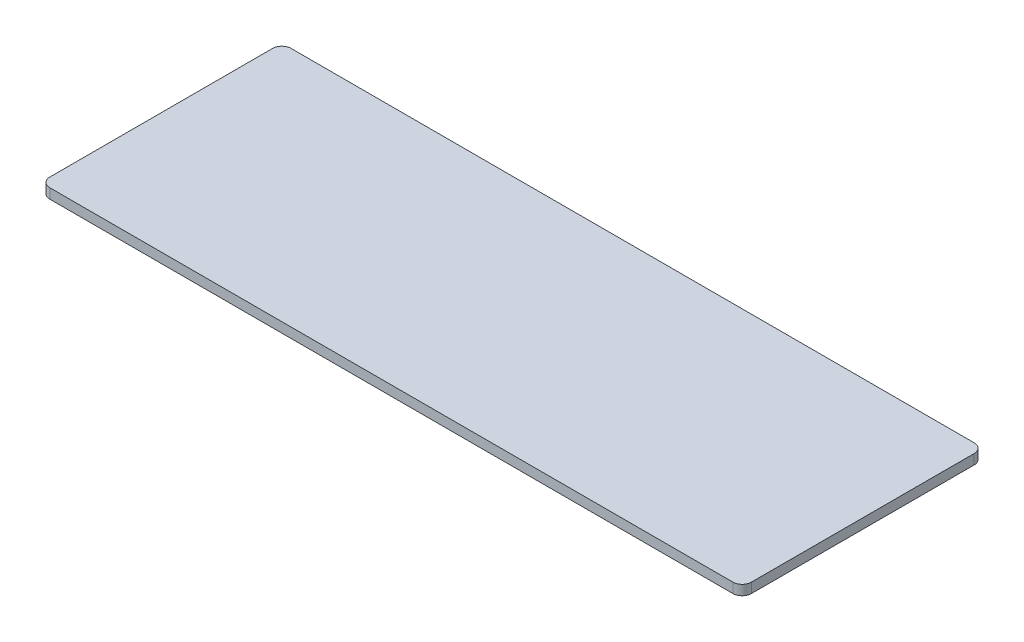
ISO-10303-21;
HEADER;
FILE_DESCRIPTION(('STEP AP214'),'2;1');
FILE_NAME('part.step','',(''),(''),'','','');
FILE_SCHEMA(('AUTOMOTIVE_DESIGN { 1 0 10303 214 1 1 1 1 }'));
ENDSEC;
DATA;
#1=APPLICATION_CONTEXT('core data for automotive mechanical design processes');
#2=APPLICATION_PROTOCOL_DEFINITION('international standard','automotive_design',2000,#1);
#3=PRODUCT_CONTEXT('',#1,'mechanical');
#4=PRODUCT('Part','Part','',(#3));
#5=PRODUCT_RELATED_PRODUCT_CATEGORY('part','',(#4));
#6=PRODUCT_DEFINITION_FORMATION('','',#4);
#7=PRODUCT_DEFINITION_CONTEXT('part definition',#1,'design');
#8=PRODUCT_DEFINITION('design','',#6,#7);
#9=PRODUCT_DEFINITION_SHAPE('','',#8);
#10=(LENGTH_UNIT() NAMED_UNIT(*) SI_UNIT(.MILLI.,.METRE.));
#11=(NAMED_UNIT(*) PLANE_ANGLE_UNIT() SI_UNIT($,.RADIAN.));
#12=(NAMED_UNIT(*) SI_UNIT($,.STERADIAN.) SOLID_ANGLE_UNIT());
#13=UNCERTAINTY_MEASURE_WITH_UNIT(LENGTH_MEASURE(1.E-05),#10,'distance_accuracy_value','');
#14=(GEOMETRIC_REPRESENTATION_CONTEXT(3) GLOBAL_UNCERTAINTY_ASSIGNED_CONTEXT((#13)) GLOBAL_UNIT_ASSIGNED_CONTEXT((#10,
#11,#12)) REPRESENTATION_CONTEXT('',''));
#15=CARTESIAN_POINT('',(0.,0.,0.));
#16=DIRECTION('',(0.,0.,1.));
#17=DIRECTION('',(1.,0.,0.));
#18=AXIS2_PLACEMENT_3D('',#15,#16,#17);
#19=CARTESIAN_POINT('',(-37.8,0.535,-13.));
#20=DIRECTION('',(1.,0.,0.));
#21=DIRECTION('',(0.,0.,-1.));
#22=AXIS2_PLACEMENT_3D('',#19,#20,#21);
#23=PLANE('',#22);
#24=DIRECTION('',(0.,0.,1.));
#25=VECTOR('',#24,1.);
#26=CARTESIAN_POINT('',(-37.8,-0.535,-13.));
#27=LINE('',#26,#25);
#28=CARTESIAN_POINT('',(-37.8,-0.535,-12.));
#29=VERTEX_POINT('',#28);
#30=CARTESIAN_POINT('',(-37.8,-0.535,12.));
#31=VERTEX_POINT('',#30);
#32=EDGE_CURVE('E131',#29,#31,#27,.T.);
#33=ORIENTED_EDGE('',*,*,#32,.T.);
#34=DIRECTION('',(0.,-1.,0.));
#35=VECTOR('',#34,1.);
#36=CARTESIAN_POINT('',(-37.8,0.535,12.));
#37=LINE('',#36,#35);
#38=CARTESIAN_POINT('',(-37.8,0.535,12.));
#39=VERTEX_POINT('',#38);
#40=EDGE_CURVE('E109',#31,#39,#37,.F.);
#41=ORIENTED_EDGE('',*,*,#40,.T.);
#42=DIRECTION('',(0.,0.,1.));
#43=VECTOR('',#42,1.);
#44=CARTESIAN_POINT('',(-37.8,0.535,-13.));
#45=LINE('',#44,#43);
#46=CARTESIAN_POINT('',(-37.8,0.535,-12.));
#47=VERTEX_POINT('',#46);
#48=EDGE_CURVE('E140',#47,#39,#45,.T.);
#49=ORIENTED_EDGE('',*,*,#48,.F.);
#50=DIRECTION('',(0.,-1.,0.));
#51=VECTOR('',#50,1.);
#52=CARTESIAN_POINT('',(-37.8,0.535,-12.));
#53=LINE('',#52,#51);
#54=EDGE_CURVE('E114',#47,#29,#53,.T.);
#55=ORIENTED_EDGE('',*,*,#54,.T.);
#56=EDGE_LOOP('',(#33,#41,#49,#55));
#57=FACE_BOUND('',#56,.T.);
#58=ADVANCED_FACE('F38',(#57),#23,.F.);
#59=CARTESIAN_POINT('',(37.8,0.535,13.));
#60=DIRECTION('',(0.,0.,-1.));
#61=DIRECTION('',(-1.,0.,0.));
#62=AXIS2_PLACEMENT_3D('',#59,#60,#61);
#63=PLANE('',#62);
#64=DIRECTION('',(1.,0.,0.));
#65=VECTOR('',#64,1.);
#66=CARTESIAN_POINT('',(37.8,0.535,13.));
#67=LINE('',#66,#65);
#68=CARTESIAN_POINT('',(-36.8,0.535,13.));
#69=VERTEX_POINT('',#68);
#70=CARTESIAN_POINT('',(36.8,0.535,13.));
#71=VERTEX_POINT('',#70);
#72=EDGE_CURVE('E124',#69,#71,#67,.T.);
#73=ORIENTED_EDGE('',*,*,#72,.F.);
#74=DIRECTION('',(0.,-1.,0.));
#75=VECTOR('',#74,1.);
#76=CARTESIAN_POINT('',(-36.8,0.535,13.));
#77=LINE('',#76,#75);
#78=CARTESIAN_POINT('',(-36.8,-0.535,13.));
#79=VERTEX_POINT('',#78);
#80=EDGE_CURVE('E108',#69,#79,#77,.T.);
#81=ORIENTED_EDGE('',*,*,#80,.T.);
#82=DIRECTION('',(1.,0.,0.));
#83=VECTOR('',#82,1.);
#84=CARTESIAN_POINT('',(37.8,-0.535,13.));
#85=LINE('',#84,#83);
#86=CARTESIAN_POINT('',(36.8,-0.535,13.));
#87=VERTEX_POINT('',#86);
#88=EDGE_CURVE('E121',#79,#87,#85,.T.);
#89=ORIENTED_EDGE('',*,*,#88,.T.);
#90=DIRECTION('',(0.,-1.,0.));
#91=VECTOR('',#90,1.);
#92=CARTESIAN_POINT('',(36.8,0.535,13.));
#93=LINE('',#92,#91);
#94=EDGE_CURVE('E126',#87,#71,#93,.F.);
#95=ORIENTED_EDGE('',*,*,#94,.T.);
#96=EDGE_LOOP('',(#73,#81,#89,#95));
#97=FACE_BOUND('',#96,.T.);
#98=ADVANCED_FACE('F120',(#97),#63,.F.);
#99=CARTESIAN_POINT('',(37.8,0.535,-13.));
#100=DIRECTION('',(-1.,0.,0.));
#101=DIRECTION('',(0.,0.,1.));
#102=AXIS2_PLACEMENT_3D('',#99,#100,#101);
#103=PLANE('',#102);
#104=DIRECTION('',(0.,0.,-1.));
#105=VECTOR('',#104,1.);
#106=CARTESIAN_POINT('',(37.8,-0.535,-13.));
#107=LINE('',#106,#105);
#108=CARTESIAN_POINT('',(37.8,-0.535,12.));
#109=VERTEX_POINT('',#108);
#110=CARTESIAN_POINT('',(37.8,-0.535,-12.));
#111=VERTEX_POINT('',#110);
#112=EDGE_CURVE('E130',#109,#111,#107,.T.);
#113=ORIENTED_EDGE('',*,*,#112,.T.);
#114=DIRECTION('',(0.,-1.,0.));
#115=VECTOR('',#114,1.);
#116=CARTESIAN_POINT('',(37.8,0.535,-12.));
#117=LINE('',#116,#115);
#118=CARTESIAN_POINT('',(37.8,0.535,-12.));
#119=VERTEX_POINT('',#118);
#120=EDGE_CURVE('E11',#111,#119,#117,.F.);
#121=ORIENTED_EDGE('',*,*,#120,.T.);
#122=DIRECTION('',(0.,0.,-1.));
#123=VECTOR('',#122,1.);
#124=CARTESIAN_POINT('',(37.8,0.535,-13.));
#125=LINE('',#124,#123);
#126=CARTESIAN_POINT('',(37.8,0.535,12.));
#127=VERTEX_POINT('',#126);
#128=EDGE_CURVE('E166',#127,#119,#125,.T.);
#129=ORIENTED_EDGE('',*,*,#128,.F.);
#130=DIRECTION('',(0.,-1.,0.));
#131=VECTOR('',#130,1.);
#132=CARTESIAN_POINT('',(37.8,0.535,12.));
#133=LINE('',#132,#131);
#134=EDGE_CURVE('E46',#127,#109,#133,.T.);
#135=ORIENTED_EDGE('',*,*,#134,.T.);
#136=EDGE_LOOP('',(#113,#121,#129,#135));
#137=FACE_BOUND('',#136,.T.);
#138=ADVANCED_FACE('F164',(#137),#103,.F.);
#139=CARTESIAN_POINT('',(37.8,0.535,-13.));
#140=DIRECTION('',(0.,0.,1.));
#141=DIRECTION('',(1.,0.,0.));
#142=AXIS2_PLACEMENT_3D('',#139,#140,#141);
#143=PLANE('',#142);
#144=DIRECTION('',(-1.,0.,0.));
#145=VECTOR('',#144,1.);
#146=CARTESIAN_POINT('',(37.8,-0.535,-13.));
#147=LINE('',#146,#145);
#148=CARTESIAN_POINT('',(36.8,-0.535,-13.));
#149=VERTEX_POINT('',#148);
#150=CARTESIAN_POINT('',(-36.8,-0.535,-13.));
#151=VERTEX_POINT('',#150);
#152=EDGE_CURVE('E134',#149,#151,#147,.T.);
#153=ORIENTED_EDGE('',*,*,#152,.T.);
#154=DIRECTION('',(0.,-1.,0.));
#155=VECTOR('',#154,1.);
#156=CARTESIAN_POINT('',(-36.8,0.535,-13.));
#157=LINE('',#156,#155);
#158=CARTESIAN_POINT('',(-36.8,0.535,-13.));
#159=VERTEX_POINT('',#158);
#160=EDGE_CURVE('E53',#151,#159,#157,.F.);
#161=ORIENTED_EDGE('',*,*,#160,.T.);
#162=DIRECTION('',(-1.,0.,0.));
#163=VECTOR('',#162,1.);
#164=CARTESIAN_POINT('',(37.8,0.535,-13.));
#165=LINE('',#164,#163);
#166=CARTESIAN_POINT('',(36.8,0.535,-13.));
#167=VERTEX_POINT('',#166);
#168=EDGE_CURVE('E141',#167,#159,#165,.T.);
#169=ORIENTED_EDGE('',*,*,#168,.F.);
#170=DIRECTION('',(0.,-1.,0.));
#171=VECTOR('',#170,1.);
#172=CARTESIAN_POINT('',(36.8,0.535,-13.));
#173=LINE('',#172,#171);
#174=EDGE_CURVE('E157',#167,#149,#173,.T.);
#175=ORIENTED_EDGE('',*,*,#174,.T.);
#176=EDGE_LOOP('',(#153,#161,#169,#175));
#177=FACE_BOUND('',#176,.T.);
#178=ADVANCED_FACE('F173',(#177),#143,.F.);
#179=CARTESIAN_POINT('',(0.,0.535,0.));
#180=DIRECTION('',(0.,-1.,0.));
#181=DIRECTION('',(0.,0.,-1.));
#182=AXIS2_PLACEMENT_3D('',#179,#180,#181);
#183=PLANE('',#182);
#184=ORIENTED_EDGE('',*,*,#48,.T.);
#185=CARTESIAN_POINT('',(-36.8,0.535,12.));
#186=DIRECTION('',(0.,-1.,0.));
#187=DIRECTION('',(0.,0.,-1.));
#188=AXIS2_PLACEMENT_3D('',#185,#186,#187);
#189=CIRCLE('',#188,1.);
#190=EDGE_CURVE('E155',#39,#69,#189,.F.);
#191=ORIENTED_EDGE('',*,*,#190,.T.);
#192=ORIENTED_EDGE('',*,*,#72,.T.);
#193=CARTESIAN_POINT('',(36.8,0.535,12.));
#194=DIRECTION('',(0.,-1.,0.));
#195=DIRECTION('',(0.,0.,-1.));
#196=AXIS2_PLACEMENT_3D('',#193,#194,#195);
#197=CIRCLE('',#196,1.);
#198=EDGE_CURVE('E150',#71,#127,#197,.F.);
#199=ORIENTED_EDGE('',*,*,#198,.T.);
#200=ORIENTED_EDGE('',*,*,#128,.T.);
#201=CARTESIAN_POINT('',(36.8,0.535,-12.));
#202=DIRECTION('',(0.,-1.,0.));
#203=DIRECTION('',(0.,0.,-1.));
#204=AXIS2_PLACEMENT_3D('',#201,#202,#203);
#205=CIRCLE('',#204,1.);
#206=EDGE_CURVE('E60',#119,#167,#205,.F.);
#207=ORIENTED_EDGE('',*,*,#206,.T.);
#208=ORIENTED_EDGE('',*,*,#168,.T.);
#209=CARTESIAN_POINT('',(-36.8,0.535,-12.));
#210=DIRECTION('',(0.,-1.,0.));
#211=DIRECTION('',(0.,0.,-1.));
#212=AXIS2_PLACEMENT_3D('',#209,#210,#211);
#213=CIRCLE('',#212,1.);
#214=EDGE_CURVE('E153',#159,#47,#213,.F.);
#215=ORIENTED_EDGE('',*,*,#214,.T.);
#216=EDGE_LOOP('',(#184,#191,#192,#199,#200,#207,#208,#215));
#217=FACE_BOUND('',#216,.T.);
#218=ADVANCED_FACE('F180',(#217),#183,.F.);
#219=CARTESIAN_POINT('',(0.,-0.535,0.));
#220=DIRECTION('',(0.,-1.,0.));
#221=DIRECTION('',(0.,0.,-1.));
#222=AXIS2_PLACEMENT_3D('',#219,#220,#221);
#223=PLANE('',#222);
#224=ORIENTED_EDGE('',*,*,#88,.F.);
#225=CARTESIAN_POINT('',(-36.8,-0.535,12.));
#226=DIRECTION('',(0.,-1.,0.));
#227=DIRECTION('',(0.,0.,-1.));
#228=AXIS2_PLACEMENT_3D('',#225,#226,#227);
#229=CIRCLE('',#228,1.);
#230=EDGE_CURVE('E104',#79,#31,#229,.T.);
#231=ORIENTED_EDGE('',*,*,#230,.T.);
#232=ORIENTED_EDGE('',*,*,#32,.F.);
#233=CARTESIAN_POINT('',(-36.8,-0.535,-12.));
#234=DIRECTION('',(0.,-1.,0.));
#235=DIRECTION('',(0.,0.,-1.));
#236=AXIS2_PLACEMENT_3D('',#233,#234,#235);
#237=CIRCLE('',#236,1.);
#238=EDGE_CURVE('E115',#29,#151,#237,.T.);
#239=ORIENTED_EDGE('',*,*,#238,.T.);
#240=ORIENTED_EDGE('',*,*,#152,.F.);
#241=CARTESIAN_POINT('',(36.8,-0.535,-12.));
#242=DIRECTION('',(0.,-1.,0.));
#243=DIRECTION('',(0.,0.,-1.));
#244=AXIS2_PLACEMENT_3D('',#241,#242,#243);
#245=CIRCLE('',#244,1.);
#246=EDGE_CURVE('E144',#149,#111,#245,.T.);
#247=ORIENTED_EDGE('',*,*,#246,.T.);
#248=ORIENTED_EDGE('',*,*,#112,.F.);
#249=CARTESIAN_POINT('',(36.8,-0.535,12.));
#250=DIRECTION('',(0.,-1.,0.));
#251=DIRECTION('',(0.,0.,-1.));
#252=AXIS2_PLACEMENT_3D('',#249,#250,#251);
#253=CIRCLE('',#252,1.);
#254=EDGE_CURVE('E125',#109,#87,#253,.T.);
#255=ORIENTED_EDGE('',*,*,#254,.T.);
#256=EDGE_LOOP('',(#224,#231,#232,#239,#240,#247,#248,#255));
#257=FACE_BOUND('',#256,.T.);
#258=ADVANCED_FACE('F128',(#257),#223,.T.);
#259=CARTESIAN_POINT('',(-36.8,0.535,12.));
#260=DIRECTION('',(0.,-1.,0.));
#261=DIRECTION('',(0.,0.,-1.));
#262=AXIS2_PLACEMENT_3D('',#259,#260,#261);
#263=CYLINDRICAL_SURFACE('',#262,1.);
#264=ORIENTED_EDGE('',*,*,#190,.F.);
#265=ORIENTED_EDGE('',*,*,#40,.F.);
#266=ORIENTED_EDGE('',*,*,#230,.F.);
#267=ORIENTED_EDGE('',*,*,#80,.F.);
#268=EDGE_LOOP('',(#264,#265,#266,#267));
#269=FACE_BOUND('',#268,.T.);
#270=ADVANCED_FACE('F107',(#269),#263,.T.);
#271=CARTESIAN_POINT('',(-36.8,0.535,-12.));
#272=DIRECTION('',(0.,-1.,0.));
#273=DIRECTION('',(0.,0.,-1.));
#274=AXIS2_PLACEMENT_3D('',#271,#272,#273);
#275=CYLINDRICAL_SURFACE('',#274,1.);
#276=ORIENTED_EDGE('',*,*,#214,.F.);
#277=ORIENTED_EDGE('',*,*,#160,.F.);
#278=ORIENTED_EDGE('',*,*,#238,.F.);
#279=ORIENTED_EDGE('',*,*,#54,.F.);
#280=EDGE_LOOP('',(#276,#277,#278,#279));
#281=FACE_BOUND('',#280,.T.);
#282=ADVANCED_FACE('F184',(#281),#275,.T.);
#283=CARTESIAN_POINT('',(36.8,0.535,-12.));
#284=DIRECTION('',(0.,-1.,0.));
#285=DIRECTION('',(0.,0.,-1.));
#286=AXIS2_PLACEMENT_3D('',#283,#284,#285);
#287=CYLINDRICAL_SURFACE('',#286,1.);
#288=ORIENTED_EDGE('',*,*,#206,.F.);
#289=ORIENTED_EDGE('',*,*,#120,.F.);
#290=ORIENTED_EDGE('',*,*,#246,.F.);
#291=ORIENTED_EDGE('',*,*,#174,.F.);
#292=EDGE_LOOP('',(#288,#289,#290,#291));
#293=FACE_BOUND('',#292,.T.);
#294=ADVANCED_FACE('F172',(#293),#287,.T.);
#295=CARTESIAN_POINT('',(36.8,0.535,12.));
#296=DIRECTION('',(0.,-1.,0.));
#297=DIRECTION('',(0.,0.,-1.));
#298=AXIS2_PLACEMENT_3D('',#295,#296,#297);
#299=CYLINDRICAL_SURFACE('',#298,1.);
#300=ORIENTED_EDGE('',*,*,#198,.F.);
#301=ORIENTED_EDGE('',*,*,#94,.F.);
#302=ORIENTED_EDGE('',*,*,#254,.F.);
#303=ORIENTED_EDGE('',*,*,#134,.F.);
#304=EDGE_LOOP('',(#300,#301,#302,#303));
#305=FACE_BOUND('',#304,.T.);
#306=ADVANCED_FACE('F40',(#305),#299,.T.);
#307=CLOSED_SHELL('',(#58,#98,#138,#178,#218,#258,#270,#282,#294,#306));
#308=MANIFOLD_SOLID_BREP('B2',#307);
#309=ADVANCED_BREP_SHAPE_REPRESENTATION('',(#18,#308),#14);
#310=SHAPE_DEFINITION_REPRESENTATION(#9,#309);
ENDSEC;
END-ISO-10303-21;
